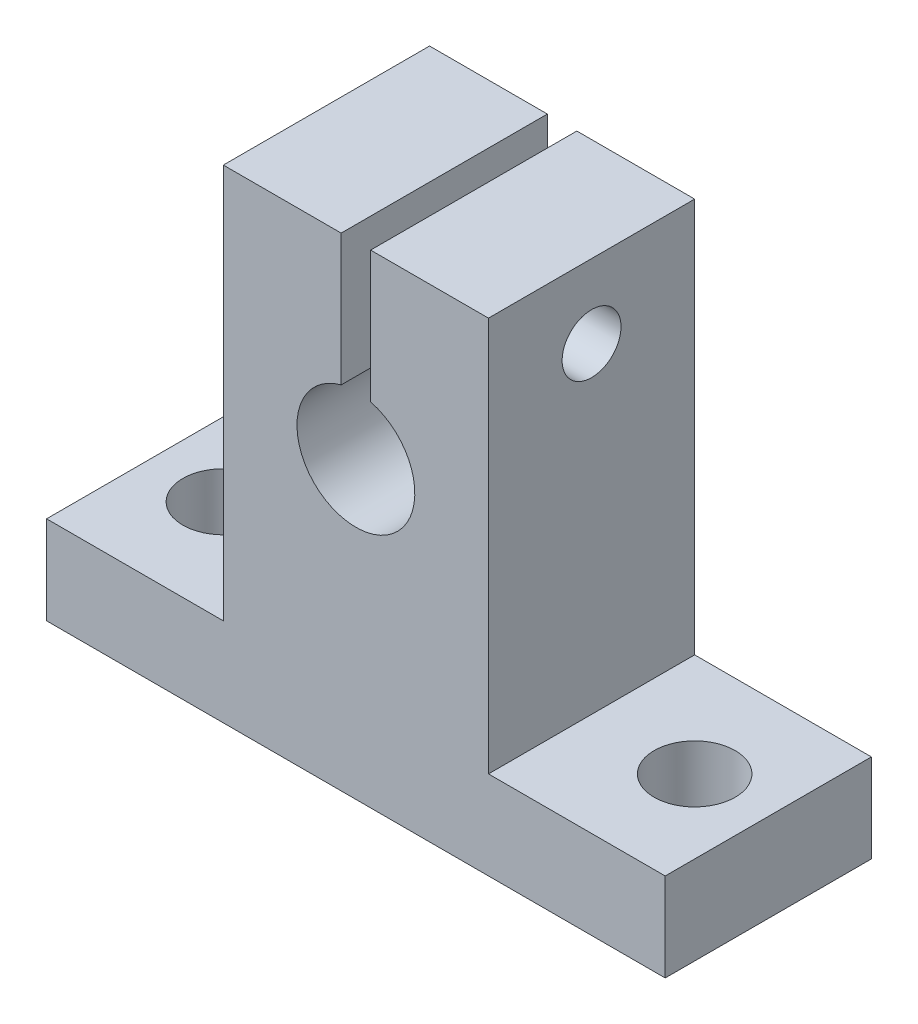
ISO-10303-21;
HEADER;
FILE_DESCRIPTION(('STEP AP214'),'2;1');
FILE_NAME('part.step','',(''),(''),'','','');
FILE_SCHEMA(('AUTOMOTIVE_DESIGN { 1 0 10303 214 1 1 1 1 }'));
ENDSEC;
DATA;
#1=APPLICATION_CONTEXT('core data for automotive mechanical design processes');
#2=APPLICATION_PROTOCOL_DEFINITION('international standard','automotive_design',2000,#1);
#3=PRODUCT_CONTEXT('',#1,'mechanical');
#4=PRODUCT('Part','Part','',(#3));
#5=PRODUCT_RELATED_PRODUCT_CATEGORY('part','',(#4));
#6=PRODUCT_DEFINITION_FORMATION('','',#4);
#7=PRODUCT_DEFINITION_CONTEXT('part definition',#1,'design');
#8=PRODUCT_DEFINITION('design','',#6,#7);
#9=PRODUCT_DEFINITION_SHAPE('','',#8);
#10=(LENGTH_UNIT() NAMED_UNIT(*) SI_UNIT(.MILLI.,.METRE.));
#11=(NAMED_UNIT(*) PLANE_ANGLE_UNIT() SI_UNIT($,.RADIAN.));
#12=(NAMED_UNIT(*) SI_UNIT($,.STERADIAN.) SOLID_ANGLE_UNIT());
#13=UNCERTAINTY_MEASURE_WITH_UNIT(LENGTH_MEASURE(1.E-05),#10,'distance_accuracy_value','');
#14=(GEOMETRIC_REPRESENTATION_CONTEXT(3) GLOBAL_UNCERTAINTY_ASSIGNED_CONTEXT((#13)) GLOBAL_UNIT_ASSIGNED_CONTEXT((#10,
#11,#12)) REPRESENTATION_CONTEXT('',''));
#15=CARTESIAN_POINT('',(0.,0.,0.));
#16=DIRECTION('',(0.,0.,1.));
#17=DIRECTION('',(1.,0.,0.));
#18=AXIS2_PLACEMENT_3D('',#15,#16,#17);
#19=CARTESIAN_POINT('',(14.6568542494924,27.8,7.));
#20=DIRECTION('',(-1.,0.,0.));
#21=DIRECTION('',(0.,0.,1.));
#22=AXIS2_PLACEMENT_3D('',#19,#20,#21);
#23=CYLINDRICAL_SURFACE('',#22,2.);
#24=CARTESIAN_POINT('',(-0.999999999999999,27.8,7.));
#25=DIRECTION('',(-1.,0.,0.));
#26=DIRECTION('',(0.,0.,1.));
#27=AXIS2_PLACEMENT_3D('',#24,#25,#26);
#28=CIRCLE('',#27,2.);
#29=CARTESIAN_POINT('',(-0.999999999999999,27.8,9.));
#30=VERTEX_POINT('',#29);
#31=EDGE_CURVE('E179',#30,#30,#28,.T.);
#32=ORIENTED_EDGE('',*,*,#31,.F.);
#33=EDGE_LOOP('',(#32));
#34=FACE_BOUND('',#33,.T.);
#35=CARTESIAN_POINT('',(-5.,27.8,7.));
#36=DIRECTION('',(-1.,0.,0.));
#37=DIRECTION('',(0.,0.,1.));
#38=AXIS2_PLACEMENT_3D('',#35,#36,#37);
#39=CIRCLE('',#38,2.);
#40=CARTESIAN_POINT('',(-5.,27.8,9.));
#41=VERTEX_POINT('',#40);
#42=EDGE_CURVE('E36',#41,#41,#39,.F.);
#43=ORIENTED_EDGE('',*,*,#42,.F.);
#44=EDGE_LOOP('',(#43));
#45=FACE_BOUND('',#44,.T.);
#46=ADVANCED_FACE('F32',(#34,#45),#23,.F.);
#47=CARTESIAN_POINT('',(-9.,32.8,14.));
#48=DIRECTION('',(0.,-1.,0.));
#49=DIRECTION('',(0.,0.,-1.));
#50=AXIS2_PLACEMENT_3D('',#47,#48,#49);
#51=PLANE('',#50);
#52=DIRECTION('',(0.,0.,-1.));
#53=VECTOR('',#52,1.);
#54=CARTESIAN_POINT('',(0.999999999999999,32.8,14.));
#55=LINE('',#54,#53);
#56=CARTESIAN_POINT('',(0.999999999999999,32.8,14.));
#57=VERTEX_POINT('',#56);
#58=CARTESIAN_POINT('',(0.999999999999999,32.8,0.));
#59=VERTEX_POINT('',#58);
#60=EDGE_CURVE('E214',#57,#59,#55,.T.);
#61=ORIENTED_EDGE('',*,*,#60,.F.);
#62=DIRECTION('',(-1.,0.,0.));
#63=VECTOR('',#62,1.);
#64=CARTESIAN_POINT('',(-9.,32.8,14.));
#65=LINE('',#64,#63);
#66=CARTESIAN_POINT('',(9.,32.8,14.));
#67=VERTEX_POINT('',#66);
#68=EDGE_CURVE('E129',#67,#57,#65,.T.);
#69=ORIENTED_EDGE('',*,*,#68,.F.);
#70=DIRECTION('',(0.,0.,-1.));
#71=VECTOR('',#70,1.);
#72=CARTESIAN_POINT('',(9.,32.8,14.));
#73=LINE('',#72,#71);
#74=CARTESIAN_POINT('',(9.,32.8,0.));
#75=VERTEX_POINT('',#74);
#76=EDGE_CURVE('E139',#67,#75,#73,.T.);
#77=ORIENTED_EDGE('',*,*,#76,.T.);
#78=DIRECTION('',(-1.,0.,0.));
#79=VECTOR('',#78,1.);
#80=CARTESIAN_POINT('',(-9.,32.8,0.));
#81=LINE('',#80,#79);
#82=EDGE_CURVE('E161',#75,#59,#81,.T.);
#83=ORIENTED_EDGE('',*,*,#82,.T.);
#84=EDGE_LOOP('',(#61,#69,#77,#83));
#85=FACE_BOUND('',#84,.T.);
#86=ADVANCED_FACE('F247',(#85),#51,.F.);
#87=CARTESIAN_POINT('',(0.,0.,14.));
#88=DIRECTION('',(0.,0.,-1.));
#89=DIRECTION('',(-1.,0.,0.));
#90=AXIS2_PLACEMENT_3D('',#87,#88,#89);
#91=PLANE('',#90);
#92=DIRECTION('',(0.,1.,0.));
#93=VECTOR('',#92,1.);
#94=CARTESIAN_POINT('',(0.999999999999999,23.8729833462074,14.));
#95=LINE('',#94,#93);
#96=CARTESIAN_POINT('',(0.999999999999999,23.8729833462074,14.));
#97=VERTEX_POINT('',#96);
#98=EDGE_CURVE('E217',#97,#57,#95,.T.);
#99=ORIENTED_EDGE('',*,*,#98,.F.);
#100=CARTESIAN_POINT('',(0.,20.,14.));
#101=DIRECTION('',(0.,0.,-1.));
#102=DIRECTION('',(-1.,0.,0.));
#103=AXIS2_PLACEMENT_3D('',#100,#101,#102);
#104=CIRCLE('',#103,4.);
#105=CARTESIAN_POINT('',(-0.999999999999999,23.8729833462074,14.));
#106=VERTEX_POINT('',#105);
#107=EDGE_CURVE('E210',#97,#106,#104,.T.);
#108=ORIENTED_EDGE('',*,*,#107,.T.);
#109=DIRECTION('',(0.,1.,0.));
#110=VECTOR('',#109,1.);
#111=CARTESIAN_POINT('',(-0.999999999999999,23.8729833462074,14.));
#112=LINE('',#111,#110);
#113=CARTESIAN_POINT('',(-0.999999999999999,32.8,14.));
#114=VERTEX_POINT('',#113);
#115=EDGE_CURVE('E126',#106,#114,#112,.T.);
#116=ORIENTED_EDGE('',*,*,#115,.T.);
#117=CARTESIAN_POINT('',(-9.,32.8,14.));
#118=VERTEX_POINT('',#117);
#119=EDGE_CURVE('E116',#114,#118,#65,.T.);
#120=ORIENTED_EDGE('',*,*,#119,.T.);
#121=DIRECTION('',(0.,-1.,0.));
#122=VECTOR('',#121,1.);
#123=CARTESIAN_POINT('',(-9.,6.,14.));
#124=LINE('',#123,#122);
#125=CARTESIAN_POINT('',(-9.,6.,14.));
#126=VERTEX_POINT('',#125);
#127=EDGE_CURVE('E121',#118,#126,#124,.T.);
#128=ORIENTED_EDGE('',*,*,#127,.T.);
#129=DIRECTION('',(-1.,0.,0.));
#130=VECTOR('',#129,1.);
#131=CARTESIAN_POINT('',(-21.,6.,14.));
#132=LINE('',#131,#130);
#133=CARTESIAN_POINT('',(-21.,6.,14.));
#134=VERTEX_POINT('',#133);
#135=EDGE_CURVE('E58',#126,#134,#132,.T.);
#136=ORIENTED_EDGE('',*,*,#135,.T.);
#137=DIRECTION('',(0.,-1.,0.));
#138=VECTOR('',#137,1.);
#139=CARTESIAN_POINT('',(-21.,0.,14.));
#140=LINE('',#139,#138);
#141=CARTESIAN_POINT('',(-21.,0.,14.));
#142=VERTEX_POINT('',#141);
#143=EDGE_CURVE('E167',#134,#142,#140,.T.);
#144=ORIENTED_EDGE('',*,*,#143,.T.);
#145=DIRECTION('',(1.,0.,0.));
#146=VECTOR('',#145,1.);
#147=CARTESIAN_POINT('',(21.,0.,14.));
#148=LINE('',#147,#146);
#149=CARTESIAN_POINT('',(21.,0.,14.));
#150=VERTEX_POINT('',#149);
#151=EDGE_CURVE('E99',#142,#150,#148,.T.);
#152=ORIENTED_EDGE('',*,*,#151,.T.);
#153=DIRECTION('',(0.,1.,0.));
#154=VECTOR('',#153,1.);
#155=CARTESIAN_POINT('',(21.,0.,14.));
#156=LINE('',#155,#154);
#157=CARTESIAN_POINT('',(21.,6.,14.));
#158=VERTEX_POINT('',#157);
#159=EDGE_CURVE('E232',#150,#158,#156,.T.);
#160=ORIENTED_EDGE('',*,*,#159,.T.);
#161=DIRECTION('',(-1.,0.,0.));
#162=VECTOR('',#161,1.);
#163=CARTESIAN_POINT('',(21.,6.,14.));
#164=LINE('',#163,#162);
#165=CARTESIAN_POINT('',(9.,6.,14.));
#166=VERTEX_POINT('',#165);
#167=EDGE_CURVE('E234',#158,#166,#164,.T.);
#168=ORIENTED_EDGE('',*,*,#167,.T.);
#169=DIRECTION('',(0.,1.,0.));
#170=VECTOR('',#169,1.);
#171=CARTESIAN_POINT('',(9.,6.,14.));
#172=LINE('',#171,#170);
#173=EDGE_CURVE('E130',#166,#67,#172,.T.);
#174=ORIENTED_EDGE('',*,*,#173,.T.);
#175=ORIENTED_EDGE('',*,*,#68,.T.);
#176=EDGE_LOOP('',(#99,#108,#116,#120,#128,#136,#144,#152,#160,#168,#174,#175));
#177=FACE_BOUND('',#176,.T.);
#178=ADVANCED_FACE('F119',(#177),#91,.F.);
#179=CARTESIAN_POINT('',(0.,0.,0.));
#180=DIRECTION('',(0.,0.,-1.));
#181=DIRECTION('',(-1.,0.,0.));
#182=AXIS2_PLACEMENT_3D('',#179,#180,#181);
#183=PLANE('',#182);
#184=CARTESIAN_POINT('',(0.,20.,0.));
#185=DIRECTION('',(0.,0.,-1.));
#186=DIRECTION('',(-1.,0.,0.));
#187=AXIS2_PLACEMENT_3D('',#184,#185,#186);
#188=CIRCLE('',#187,4.);
#189=CARTESIAN_POINT('',(0.999999999999999,23.8729833462074,0.));
#190=VERTEX_POINT('',#189);
#191=CARTESIAN_POINT('',(-0.999999999999999,23.8729833462074,0.));
#192=VERTEX_POINT('',#191);
#193=EDGE_CURVE('E49',#190,#192,#188,.T.);
#194=ORIENTED_EDGE('',*,*,#193,.F.);
#195=DIRECTION('',(0.,1.,0.));
#196=VECTOR('',#195,1.);
#197=CARTESIAN_POINT('',(0.999999999999999,23.8729833462074,0.));
#198=LINE('',#197,#196);
#199=EDGE_CURVE('E205',#190,#59,#198,.T.);
#200=ORIENTED_EDGE('',*,*,#199,.T.);
#201=ORIENTED_EDGE('',*,*,#82,.F.);
#202=DIRECTION('',(0.,1.,0.));
#203=VECTOR('',#202,1.);
#204=CARTESIAN_POINT('',(9.,6.,0.));
#205=LINE('',#204,#203);
#206=CARTESIAN_POINT('',(9.,6.,0.));
#207=VERTEX_POINT('',#206);
#208=EDGE_CURVE('E159',#207,#75,#205,.T.);
#209=ORIENTED_EDGE('',*,*,#208,.F.);
#210=DIRECTION('',(-1.,0.,0.));
#211=VECTOR('',#210,1.);
#212=CARTESIAN_POINT('',(21.,6.,0.));
#213=LINE('',#212,#211);
#214=CARTESIAN_POINT('',(21.,6.,0.));
#215=VERTEX_POINT('',#214);
#216=EDGE_CURVE('E157',#215,#207,#213,.T.);
#217=ORIENTED_EDGE('',*,*,#216,.F.);
#218=DIRECTION('',(0.,1.,0.));
#219=VECTOR('',#218,1.);
#220=CARTESIAN_POINT('',(21.,0.,0.));
#221=LINE('',#220,#219);
#222=CARTESIAN_POINT('',(21.,0.,0.));
#223=VERTEX_POINT('',#222);
#224=EDGE_CURVE('E155',#223,#215,#221,.T.);
#225=ORIENTED_EDGE('',*,*,#224,.F.);
#226=DIRECTION('',(1.,0.,0.));
#227=VECTOR('',#226,1.);
#228=CARTESIAN_POINT('',(21.,0.,0.));
#229=LINE('',#228,#227);
#230=CARTESIAN_POINT('',(-21.,0.,0.));
#231=VERTEX_POINT('',#230);
#232=EDGE_CURVE('E152',#231,#223,#229,.T.);
#233=ORIENTED_EDGE('',*,*,#232,.F.);
#234=DIRECTION('',(0.,-1.,0.));
#235=VECTOR('',#234,1.);
#236=CARTESIAN_POINT('',(-21.,0.,0.));
#237=LINE('',#236,#235);
#238=CARTESIAN_POINT('',(-21.,6.,0.));
#239=VERTEX_POINT('',#238);
#240=EDGE_CURVE('E149',#239,#231,#237,.T.);
#241=ORIENTED_EDGE('',*,*,#240,.F.);
#242=DIRECTION('',(-1.,0.,0.));
#243=VECTOR('',#242,1.);
#244=CARTESIAN_POINT('',(-21.,6.,0.));
#245=LINE('',#244,#243);
#246=CARTESIAN_POINT('',(-9.,6.,0.));
#247=VERTEX_POINT('',#246);
#248=EDGE_CURVE('E91',#247,#239,#245,.T.);
#249=ORIENTED_EDGE('',*,*,#248,.F.);
#250=DIRECTION('',(0.,-1.,0.));
#251=VECTOR('',#250,1.);
#252=CARTESIAN_POINT('',(-9.,6.,0.));
#253=LINE('',#252,#251);
#254=CARTESIAN_POINT('',(-9.,32.8,0.));
#255=VERTEX_POINT('',#254);
#256=EDGE_CURVE('E164',#255,#247,#253,.T.);
#257=ORIENTED_EDGE('',*,*,#256,.F.);
#258=CARTESIAN_POINT('',(-0.999999999999999,32.8,0.));
#259=VERTEX_POINT('',#258);
#260=EDGE_CURVE('E136',#259,#255,#81,.T.);
#261=ORIENTED_EDGE('',*,*,#260,.F.);
#262=DIRECTION('',(0.,1.,0.));
#263=VECTOR('',#262,1.);
#264=CARTESIAN_POINT('',(-0.999999999999999,23.8729833462074,0.));
#265=LINE('',#264,#263);
#266=EDGE_CURVE('E220',#192,#259,#265,.T.);
#267=ORIENTED_EDGE('',*,*,#266,.F.);
#268=EDGE_LOOP('',(#194,#200,#201,#209,#217,#225,#233,#241,#249,#257,#261,#267));
#269=FACE_BOUND('',#268,.T.);
#270=ADVANCED_FACE('F256',(#269),#183,.T.);
#271=CARTESIAN_POINT('',(-21.,0.,14.));
#272=DIRECTION('',(1.,0.,0.));
#273=DIRECTION('',(0.,0.,-1.));
#274=AXIS2_PLACEMENT_3D('',#271,#272,#273);
#275=PLANE('',#274);
#276=ORIENTED_EDGE('',*,*,#240,.T.);
#277=DIRECTION('',(0.,0.,-1.));
#278=VECTOR('',#277,1.);
#279=CARTESIAN_POINT('',(-21.,0.,14.));
#280=LINE('',#279,#278);
#281=EDGE_CURVE('E11',#142,#231,#280,.T.);
#282=ORIENTED_EDGE('',*,*,#281,.F.);
#283=ORIENTED_EDGE('',*,*,#143,.F.);
#284=DIRECTION('',(0.,0.,-1.));
#285=VECTOR('',#284,1.);
#286=CARTESIAN_POINT('',(-21.,6.,14.));
#287=LINE('',#286,#285);
#288=EDGE_CURVE('E144',#134,#239,#287,.T.);
#289=ORIENTED_EDGE('',*,*,#288,.T.);
#290=EDGE_LOOP('',(#276,#282,#283,#289));
#291=FACE_BOUND('',#290,.T.);
#292=ADVANCED_FACE('F34',(#291),#275,.F.);
#293=CARTESIAN_POINT('',(21.,0.,14.));
#294=DIRECTION('',(0.,1.,0.));
#295=DIRECTION('',(0.,0.,1.));
#296=AXIS2_PLACEMENT_3D('',#293,#294,#295);
#297=PLANE('',#296);
#298=CARTESIAN_POINT('',(16.,0.,7.));
#299=DIRECTION('',(0.,-1.,0.));
#300=DIRECTION('',(0.,0.,-1.));
#301=AXIS2_PLACEMENT_3D('',#298,#299,#300);
#302=CIRCLE('',#301,2.75);
#303=CARTESIAN_POINT('',(16.,0.,4.25));
#304=VERTEX_POINT('',#303);
#305=EDGE_CURVE('E198',#304,#304,#302,.T.);
#306=ORIENTED_EDGE('',*,*,#305,.F.);
#307=EDGE_LOOP('',(#306));
#308=FACE_BOUND('',#307,.T.);
#309=CARTESIAN_POINT('',(-16.,0.,6.99999999999998));
#310=DIRECTION('',(0.,-1.,0.));
#311=DIRECTION('',(0.,0.,1.));
#312=AXIS2_PLACEMENT_3D('',#309,#310,#311);
#313=CIRCLE('',#312,2.75);
#314=CARTESIAN_POINT('',(-16.,0.,9.74999999999998));
#315=VERTEX_POINT('',#314);
#316=EDGE_CURVE('E186',#315,#315,#313,.T.);
#317=ORIENTED_EDGE('',*,*,#316,.F.);
#318=EDGE_LOOP('',(#317));
#319=FACE_BOUND('',#318,.T.);
#320=ORIENTED_EDGE('',*,*,#232,.T.);
#321=DIRECTION('',(0.,0.,-1.));
#322=VECTOR('',#321,1.);
#323=CARTESIAN_POINT('',(21.,0.,14.));
#324=LINE('',#323,#322);
#325=EDGE_CURVE('E41',#150,#223,#324,.T.);
#326=ORIENTED_EDGE('',*,*,#325,.F.);
#327=ORIENTED_EDGE('',*,*,#151,.F.);
#328=ORIENTED_EDGE('',*,*,#281,.T.);
#329=EDGE_LOOP('',(#320,#326,#327,#328));
#330=FACE_BOUND('',#329,.T.);
#331=ADVANCED_FACE('F275',(#308,#319,#330),#297,.F.);
#332=CARTESIAN_POINT('',(21.,0.,14.));
#333=DIRECTION('',(-1.,0.,0.));
#334=DIRECTION('',(0.,0.,1.));
#335=AXIS2_PLACEMENT_3D('',#332,#333,#334);
#336=PLANE('',#335);
#337=ORIENTED_EDGE('',*,*,#224,.T.);
#338=DIRECTION('',(0.,0.,-1.));
#339=VECTOR('',#338,1.);
#340=CARTESIAN_POINT('',(21.,6.,14.));
#341=LINE('',#340,#339);
#342=EDGE_CURVE('E175',#158,#215,#341,.T.);
#343=ORIENTED_EDGE('',*,*,#342,.F.);
#344=ORIENTED_EDGE('',*,*,#159,.F.);
#345=ORIENTED_EDGE('',*,*,#325,.T.);
#346=EDGE_LOOP('',(#337,#343,#344,#345));
#347=FACE_BOUND('',#346,.T.);
#348=ADVANCED_FACE('F278',(#347),#336,.F.);
#349=CARTESIAN_POINT('',(21.,6.,14.));
#350=DIRECTION('',(0.,-1.,0.));
#351=DIRECTION('',(0.,0.,-1.));
#352=AXIS2_PLACEMENT_3D('',#349,#350,#351);
#353=PLANE('',#352);
#354=CARTESIAN_POINT('',(16.,6.,7.));
#355=DIRECTION('',(0.,-1.,0.));
#356=DIRECTION('',(0.,0.,-1.));
#357=AXIS2_PLACEMENT_3D('',#354,#355,#356);
#358=CIRCLE('',#357,2.75);
#359=CARTESIAN_POINT('',(16.,6.,4.25));
#360=VERTEX_POINT('',#359);
#361=EDGE_CURVE('E201',#360,#360,#358,.F.);
#362=ORIENTED_EDGE('',*,*,#361,.F.);
#363=EDGE_LOOP('',(#362));
#364=FACE_BOUND('',#363,.T.);
#365=ORIENTED_EDGE('',*,*,#216,.T.);
#366=DIRECTION('',(0.,0.,-1.));
#367=VECTOR('',#366,1.);
#368=CARTESIAN_POINT('',(9.,6.,14.));
#369=LINE('',#368,#367);
#370=EDGE_CURVE('E172',#166,#207,#369,.T.);
#371=ORIENTED_EDGE('',*,*,#370,.F.);
#372=ORIENTED_EDGE('',*,*,#167,.F.);
#373=ORIENTED_EDGE('',*,*,#342,.T.);
#374=EDGE_LOOP('',(#365,#371,#372,#373));
#375=FACE_BOUND('',#374,.T.);
#376=ADVANCED_FACE('F281',(#364,#375),#353,.F.);
#377=CARTESIAN_POINT('',(9.,6.,14.));
#378=DIRECTION('',(-1.,0.,0.));
#379=DIRECTION('',(0.,0.,1.));
#380=AXIS2_PLACEMENT_3D('',#377,#378,#379);
#381=PLANE('',#380);
#382=CARTESIAN_POINT('',(9.,27.8,7.));
#383=DIRECTION('',(-1.,0.,0.));
#384=DIRECTION('',(0.,0.,1.));
#385=AXIS2_PLACEMENT_3D('',#382,#383,#384);
#386=CIRCLE('',#385,2.);
#387=CARTESIAN_POINT('',(9.,27.8,9.));
#388=VERTEX_POINT('',#387);
#389=EDGE_CURVE('E182',#388,#388,#386,.F.);
#390=ORIENTED_EDGE('',*,*,#389,.F.);
#391=EDGE_LOOP('',(#390));
#392=FACE_BOUND('',#391,.T.);
#393=ORIENTED_EDGE('',*,*,#208,.T.);
#394=ORIENTED_EDGE('',*,*,#76,.F.);
#395=ORIENTED_EDGE('',*,*,#173,.F.);
#396=ORIENTED_EDGE('',*,*,#370,.T.);
#397=EDGE_LOOP('',(#393,#394,#395,#396));
#398=FACE_BOUND('',#397,.T.);
#399=ADVANCED_FACE('F242',(#392,#398),#381,.F.);
#400=ORIENTED_EDGE('',*,*,#119,.F.);
#401=DIRECTION('',(0.,0.,-1.));
#402=VECTOR('',#401,1.);
#403=CARTESIAN_POINT('',(-0.999999999999999,32.8,14.));
#404=LINE('',#403,#402);
#405=EDGE_CURVE('E222',#114,#259,#404,.T.);
#406=ORIENTED_EDGE('',*,*,#405,.T.);
#407=ORIENTED_EDGE('',*,*,#260,.T.);
#408=DIRECTION('',(0.,0.,-1.));
#409=VECTOR('',#408,1.);
#410=CARTESIAN_POINT('',(-9.,32.8,14.));
#411=LINE('',#410,#409);
#412=EDGE_CURVE('E133',#118,#255,#411,.T.);
#413=ORIENTED_EDGE('',*,*,#412,.F.);
#414=EDGE_LOOP('',(#400,#406,#407,#413));
#415=FACE_BOUND('',#414,.T.);
#416=ADVANCED_FACE('F134',(#415),#51,.F.);
#417=CARTESIAN_POINT('',(-9.,6.,14.));
#418=DIRECTION('',(1.,0.,0.));
#419=DIRECTION('',(0.,0.,-1.));
#420=AXIS2_PLACEMENT_3D('',#417,#418,#419);
#421=PLANE('',#420);
#422=CARTESIAN_POINT('',(-9.,27.8,7.));
#423=DIRECTION('',(-1.,0.,0.));
#424=DIRECTION('',(0.,0.,1.));
#425=AXIS2_PLACEMENT_3D('',#422,#423,#424);
#426=CIRCLE('',#425,3.5);
#427=CARTESIAN_POINT('',(-9.,27.8,10.5));
#428=VERTEX_POINT('',#427);
#429=EDGE_CURVE('E195',#428,#428,#426,.T.);
#430=ORIENTED_EDGE('',*,*,#429,.F.);
#431=EDGE_LOOP('',(#430));
#432=FACE_BOUND('',#431,.T.);
#433=ORIENTED_EDGE('',*,*,#256,.T.);
#434=DIRECTION('',(0.,0.,-1.));
#435=VECTOR('',#434,1.);
#436=CARTESIAN_POINT('',(-9.,6.,14.));
#437=LINE('',#436,#435);
#438=EDGE_CURVE('E140',#126,#247,#437,.T.);
#439=ORIENTED_EDGE('',*,*,#438,.F.);
#440=ORIENTED_EDGE('',*,*,#127,.F.);
#441=ORIENTED_EDGE('',*,*,#412,.T.);
#442=EDGE_LOOP('',(#433,#439,#440,#441));
#443=FACE_BOUND('',#442,.T.);
#444=ADVANCED_FACE('F142',(#432,#443),#421,.F.);
#445=CARTESIAN_POINT('',(-21.,6.,14.));
#446=DIRECTION('',(0.,-1.,0.));
#447=DIRECTION('',(0.,0.,-1.));
#448=AXIS2_PLACEMENT_3D('',#445,#446,#447);
#449=PLANE('',#448);
#450=CARTESIAN_POINT('',(-16.,6.,6.99999999999998));
#451=DIRECTION('',(0.,-1.,0.));
#452=DIRECTION('',(0.,0.,-1.));
#453=AXIS2_PLACEMENT_3D('',#450,#451,#452);
#454=CIRCLE('',#453,2.75);
#455=CARTESIAN_POINT('',(-16.,6.,4.24999999999999));
#456=VERTEX_POINT('',#455);
#457=EDGE_CURVE('E202',#456,#456,#454,.F.);
#458=ORIENTED_EDGE('',*,*,#457,.F.);
#459=EDGE_LOOP('',(#458));
#460=FACE_BOUND('',#459,.T.);
#461=ORIENTED_EDGE('',*,*,#248,.T.);
#462=ORIENTED_EDGE('',*,*,#288,.F.);
#463=ORIENTED_EDGE('',*,*,#135,.F.);
#464=ORIENTED_EDGE('',*,*,#438,.T.);
#465=EDGE_LOOP('',(#461,#462,#463,#464));
#466=FACE_BOUND('',#465,.T.);
#467=ADVANCED_FACE('F269',(#460,#466),#449,.F.);
#468=CARTESIAN_POINT('',(0.,20.,14.));
#469=DIRECTION('',(0.,0.,-1.));
#470=DIRECTION('',(-1.,0.,0.));
#471=AXIS2_PLACEMENT_3D('',#468,#469,#470);
#472=CYLINDRICAL_SURFACE('',#471,4.);
#473=ORIENTED_EDGE('',*,*,#193,.T.);
#474=DIRECTION('',(0.,0.,-1.));
#475=VECTOR('',#474,1.);
#476=CARTESIAN_POINT('',(-0.999999999999999,23.8729833462074,14.));
#477=LINE('',#476,#475);
#478=EDGE_CURVE('E212',#106,#192,#477,.T.);
#479=ORIENTED_EDGE('',*,*,#478,.F.);
#480=ORIENTED_EDGE('',*,*,#107,.F.);
#481=DIRECTION('',(0.,0.,-1.));
#482=VECTOR('',#481,1.);
#483=CARTESIAN_POINT('',(0.999999999999999,23.8729833462074,14.));
#484=LINE('',#483,#482);
#485=EDGE_CURVE('E153',#97,#190,#484,.T.);
#486=ORIENTED_EDGE('',*,*,#485,.T.);
#487=EDGE_LOOP('',(#473,#479,#480,#486));
#488=FACE_BOUND('',#487,.T.);
#489=ADVANCED_FACE('F265',(#488),#472,.F.);
#490=CARTESIAN_POINT('',(0.999999999999999,23.8729833462074,14.));
#491=DIRECTION('',(-1.,0.,0.));
#492=DIRECTION('',(0.,0.,1.));
#493=AXIS2_PLACEMENT_3D('',#490,#491,#492);
#494=PLANE('',#493);
#495=CARTESIAN_POINT('',(0.999999999999999,27.8,7.));
#496=DIRECTION('',(-1.,0.,0.));
#497=DIRECTION('',(0.,0.,1.));
#498=AXIS2_PLACEMENT_3D('',#495,#496,#497);
#499=CIRCLE('',#498,2.);
#500=CARTESIAN_POINT('',(0.999999999999999,27.8,9.));
#501=VERTEX_POINT('',#500);
#502=EDGE_CURVE('E181',#501,#501,#499,.T.);
#503=ORIENTED_EDGE('',*,*,#502,.F.);
#504=EDGE_LOOP('',(#503));
#505=FACE_BOUND('',#504,.T.);
#506=ORIENTED_EDGE('',*,*,#199,.F.);
#507=ORIENTED_EDGE('',*,*,#485,.F.);
#508=ORIENTED_EDGE('',*,*,#98,.T.);
#509=ORIENTED_EDGE('',*,*,#60,.T.);
#510=EDGE_LOOP('',(#506,#507,#508,#509));
#511=FACE_BOUND('',#510,.T.);
#512=ADVANCED_FACE('F252',(#505,#511),#494,.T.);
#513=CARTESIAN_POINT('',(-0.999999999999999,23.8729833462074,14.));
#514=DIRECTION('',(-1.,0.,0.));
#515=DIRECTION('',(0.,0.,1.));
#516=AXIS2_PLACEMENT_3D('',#513,#514,#515);
#517=PLANE('',#516);
#518=ORIENTED_EDGE('',*,*,#31,.T.);
#519=EDGE_LOOP('',(#518));
#520=FACE_BOUND('',#519,.T.);
#521=ORIENTED_EDGE('',*,*,#266,.T.);
#522=ORIENTED_EDGE('',*,*,#405,.F.);
#523=ORIENTED_EDGE('',*,*,#115,.F.);
#524=ORIENTED_EDGE('',*,*,#478,.T.);
#525=EDGE_LOOP('',(#521,#522,#523,#524));
#526=FACE_BOUND('',#525,.T.);
#527=ADVANCED_FACE('F267',(#520,#526),#517,.F.);
#528=CARTESIAN_POINT('',(-16.,32.801,6.99999999999998));
#529=DIRECTION('',(0.,-1.,0.));
#530=DIRECTION('',(0.,0.,-1.));
#531=AXIS2_PLACEMENT_3D('',#528,#529,#530);
#532=CYLINDRICAL_SURFACE('',#531,2.75);
#533=ORIENTED_EDGE('',*,*,#316,.T.);
#534=EDGE_LOOP('',(#533));
#535=FACE_BOUND('',#534,.T.);
#536=ORIENTED_EDGE('',*,*,#457,.T.);
#537=EDGE_LOOP('',(#536));
#538=FACE_BOUND('',#537,.T.);
#539=ADVANCED_FACE('F315',(#535,#538),#532,.F.);
#540=CARTESIAN_POINT('',(16.,32.801,7.));
#541=DIRECTION('',(0.,-1.,0.));
#542=DIRECTION('',(0.,0.,-1.));
#543=AXIS2_PLACEMENT_3D('',#540,#541,#542);
#544=CYLINDRICAL_SURFACE('',#543,2.75);
#545=ORIENTED_EDGE('',*,*,#305,.T.);
#546=EDGE_LOOP('',(#545));
#547=FACE_BOUND('',#546,.T.);
#548=ORIENTED_EDGE('',*,*,#361,.T.);
#549=EDGE_LOOP('',(#548));
#550=FACE_BOUND('',#549,.T.);
#551=ADVANCED_FACE('F306',(#547,#550),#544,.F.);
#552=ORIENTED_EDGE('',*,*,#502,.T.);
#553=EDGE_LOOP('',(#552));
#554=FACE_BOUND('',#553,.T.);
#555=ORIENTED_EDGE('',*,*,#389,.T.);
#556=EDGE_LOOP('',(#555));
#557=FACE_BOUND('',#556,.T.);
#558=ADVANCED_FACE('F296',(#554,#557),#23,.F.);
#559=CARTESIAN_POINT('',(-5.,27.8,7.));
#560=DIRECTION('',(-1.,0.,0.));
#561=DIRECTION('',(0.,0.,1.));
#562=AXIS2_PLACEMENT_3D('',#559,#560,#561);
#563=PLANE('',#562);
#564=CARTESIAN_POINT('',(-5.,27.8,7.));
#565=DIRECTION('',(-1.,0.,0.));
#566=DIRECTION('',(0.,0.,1.));
#567=AXIS2_PLACEMENT_3D('',#564,#565,#566);
#568=CIRCLE('',#567,3.5);
#569=CARTESIAN_POINT('',(-5.,27.8,10.5));
#570=VERTEX_POINT('',#569);
#571=EDGE_CURVE('E193',#570,#570,#568,.T.);
#572=ORIENTED_EDGE('',*,*,#571,.T.);
#573=EDGE_LOOP('',(#572));
#574=FACE_BOUND('',#573,.T.);
#575=ORIENTED_EDGE('',*,*,#42,.T.);
#576=EDGE_LOOP('',(#575));
#577=FACE_BOUND('',#576,.T.);
#578=ADVANCED_FACE('F305',(#574,#577),#563,.T.);
#579=CARTESIAN_POINT('',(-5.,27.8,7.));
#580=DIRECTION('',(-1.,0.,0.));
#581=DIRECTION('',(0.,0.,1.));
#582=AXIS2_PLACEMENT_3D('',#579,#580,#581);
#583=CYLINDRICAL_SURFACE('',#582,3.5);
#584=ORIENTED_EDGE('',*,*,#571,.F.);
#585=EDGE_LOOP('',(#584));
#586=FACE_BOUND('',#585,.T.);
#587=ORIENTED_EDGE('',*,*,#429,.T.);
#588=EDGE_LOOP('',(#587));
#589=FACE_BOUND('',#588,.T.);
#590=ADVANCED_FACE('F312',(#586,#589),#583,.F.);
#591=CLOSED_SHELL('',(#46,#86,#178,#270,#292,#331,#348,#376,#399,#416,#444,#467,#489,#512,#527,
#539,#551,#558,#578,#590));
#592=MANIFOLD_SOLID_BREP('B2',#591);
#593=ADVANCED_BREP_SHAPE_REPRESENTATION('',(#18,#592),#14);
#594=SHAPE_DEFINITION_REPRESENTATION(#9,#593);
ENDSEC;
END-ISO-10303-21;
